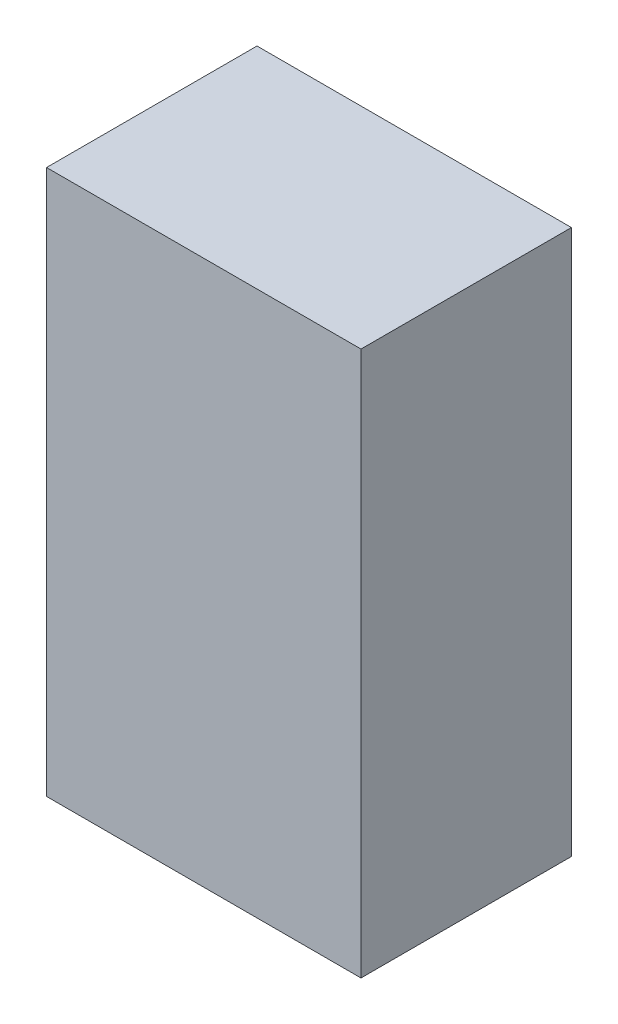
ISO-10303-21;
HEADER;
FILE_DESCRIPTION(('STEP AP214'),'2;1');
FILE_NAME('part.step','',(''),(''),'','','');
FILE_SCHEMA(('AUTOMOTIVE_DESIGN { 1 0 10303 214 1 1 1 1 }'));
ENDSEC;
DATA;
#1=APPLICATION_CONTEXT('core data for automotive mechanical design processes');
#2=APPLICATION_PROTOCOL_DEFINITION('international standard','automotive_design',2000,#1);
#3=PRODUCT_CONTEXT('',#1,'mechanical');
#4=PRODUCT('Part','Part','',(#3));
#5=PRODUCT_RELATED_PRODUCT_CATEGORY('part','',(#4));
#6=PRODUCT_DEFINITION_FORMATION('','',#4);
#7=PRODUCT_DEFINITION_CONTEXT('part definition',#1,'design');
#8=PRODUCT_DEFINITION('design','',#6,#7);
#9=PRODUCT_DEFINITION_SHAPE('','',#8);
#10=(LENGTH_UNIT() NAMED_UNIT(*) SI_UNIT(.MILLI.,.METRE.));
#11=(NAMED_UNIT(*) PLANE_ANGLE_UNIT() SI_UNIT($,.RADIAN.));
#12=(NAMED_UNIT(*) SI_UNIT($,.STERADIAN.) SOLID_ANGLE_UNIT());
#13=UNCERTAINTY_MEASURE_WITH_UNIT(LENGTH_MEASURE(1.E-05),#10,'distance_accuracy_value','');
#14=(GEOMETRIC_REPRESENTATION_CONTEXT(3) GLOBAL_UNCERTAINTY_ASSIGNED_CONTEXT((#13)) GLOBAL_UNIT_ASSIGNED_CONTEXT((#10,
#11,#12)) REPRESENTATION_CONTEXT('',''));
#15=CARTESIAN_POINT('',(0.,0.,0.));
#16=DIRECTION('',(0.,0.,1.));
#17=DIRECTION('',(1.,0.,0.));
#18=AXIS2_PLACEMENT_3D('',#15,#16,#17);
#19=CARTESIAN_POINT('',(-0.635,1.10000034,0.85000084));
#20=DIRECTION('',(0.,0.,1.));
#21=DIRECTION('',(1.,0.,0.));
#22=AXIS2_PLACEMENT_3D('',#19,#20,#21);
#23=PLANE('',#22);
#24=DIRECTION('',(0.,1.,0.));
#25=VECTOR('',#24,1.);
#26=CARTESIAN_POINT('',(0.635,1.10000034,0.85000084));
#27=LINE('',#26,#25);
#28=CARTESIAN_POINT('',(0.635,1.10000034,0.85000084));
#29=VERTEX_POINT('',#28);
#30=CARTESIAN_POINT('',(0.635,-1.10000034,0.85000084));
#31=VERTEX_POINT('',#30);
#32=EDGE_CURVE('E52',#29,#31,#27,.F.);
#33=ORIENTED_EDGE('',*,*,#32,.F.);
#34=DIRECTION('',(1.,0.,0.));
#35=VECTOR('',#34,1.);
#36=CARTESIAN_POINT('',(-0.635,1.10000034,0.85000084));
#37=LINE('',#36,#35);
#38=CARTESIAN_POINT('',(-0.635,1.10000034,0.85000084));
#39=VERTEX_POINT('',#38);
#40=EDGE_CURVE('E19',#29,#39,#37,.F.);
#41=ORIENTED_EDGE('',*,*,#40,.T.);
#42=DIRECTION('',(0.,1.,0.));
#43=VECTOR('',#42,1.);
#44=CARTESIAN_POINT('',(-0.635,-1.10000034,0.85000084));
#45=LINE('',#44,#43);
#46=CARTESIAN_POINT('',(-0.635,-1.10000034,0.85000084));
#47=VERTEX_POINT('',#46);
#48=EDGE_CURVE('E66',#47,#39,#45,.T.);
#49=ORIENTED_EDGE('',*,*,#48,.F.);
#50=DIRECTION('',(1.,0.,0.));
#51=VECTOR('',#50,1.);
#52=CARTESIAN_POINT('',(0.635,-1.10000034,0.85000084));
#53=LINE('',#52,#51);
#54=EDGE_CURVE('E57',#31,#47,#53,.F.);
#55=ORIENTED_EDGE('',*,*,#54,.F.);
#56=EDGE_LOOP('',(#33,#41,#49,#55));
#57=FACE_BOUND('',#56,.T.);
#58=ADVANCED_FACE('F16',(#57),#23,.T.);
#59=CARTESIAN_POINT('',(-0.635,-1.10000034,0.));
#60=DIRECTION('',(-1.,0.,0.));
#61=DIRECTION('',(0.,0.,1.));
#62=AXIS2_PLACEMENT_3D('',#59,#60,#61);
#63=PLANE('',#62);
#64=DIRECTION('',(0.,0.,1.));
#65=VECTOR('',#64,1.);
#66=CARTESIAN_POINT('',(-0.635,1.10000034,0.));
#67=LINE('',#66,#65);
#68=CARTESIAN_POINT('',(-0.635,1.10000034,0.));
#69=VERTEX_POINT('',#68);
#70=EDGE_CURVE('E79',#69,#39,#67,.T.);
#71=ORIENTED_EDGE('',*,*,#70,.F.);
#72=DIRECTION('',(0.,1.,0.));
#73=VECTOR('',#72,1.);
#74=CARTESIAN_POINT('',(-0.635,1.10000034,0.));
#75=LINE('',#74,#73);
#76=CARTESIAN_POINT('',(-0.635,-1.10000034,0.));
#77=VERTEX_POINT('',#76);
#78=EDGE_CURVE('E74',#69,#77,#75,.F.);
#79=ORIENTED_EDGE('',*,*,#78,.T.);
#80=DIRECTION('',(0.,0.,-1.));
#81=VECTOR('',#80,1.);
#82=CARTESIAN_POINT('',(-0.635,-1.10000034,0.));
#83=LINE('',#82,#81);
#84=EDGE_CURVE('E62',#47,#77,#83,.T.);
#85=ORIENTED_EDGE('',*,*,#84,.F.);
#86=ORIENTED_EDGE('',*,*,#48,.T.);
#87=EDGE_LOOP('',(#71,#79,#85,#86));
#88=FACE_BOUND('',#87,.T.);
#89=ADVANCED_FACE('F73',(#88),#63,.T.);
#90=CARTESIAN_POINT('',(0.635,-1.10000034,0.));
#91=DIRECTION('',(0.,-1.,0.));
#92=DIRECTION('',(0.,0.,-1.));
#93=AXIS2_PLACEMENT_3D('',#90,#91,#92);
#94=PLANE('',#93);
#95=ORIENTED_EDGE('',*,*,#84,.T.);
#96=DIRECTION('',(1.,0.,0.));
#97=VECTOR('',#96,1.);
#98=CARTESIAN_POINT('',(-0.635,-1.10000034,0.));
#99=LINE('',#98,#97);
#100=CARTESIAN_POINT('',(0.635,-1.10000034,0.));
#101=VERTEX_POINT('',#100);
#102=EDGE_CURVE('E83',#77,#101,#99,.T.);
#103=ORIENTED_EDGE('',*,*,#102,.T.);
#104=DIRECTION('',(0.,0.,-1.));
#105=VECTOR('',#104,1.);
#106=CARTESIAN_POINT('',(0.635,-1.10000034,0.));
#107=LINE('',#106,#105);
#108=EDGE_CURVE('E64',#31,#101,#107,.T.);
#109=ORIENTED_EDGE('',*,*,#108,.F.);
#110=ORIENTED_EDGE('',*,*,#54,.T.);
#111=EDGE_LOOP('',(#95,#103,#109,#110));
#112=FACE_BOUND('',#111,.T.);
#113=ADVANCED_FACE('F59',(#112),#94,.T.);
#114=CARTESIAN_POINT('',(0.635,1.10000034,0.));
#115=DIRECTION('',(1.,0.,0.));
#116=DIRECTION('',(0.,0.,-1.));
#117=AXIS2_PLACEMENT_3D('',#114,#115,#116);
#118=PLANE('',#117);
#119=ORIENTED_EDGE('',*,*,#108,.T.);
#120=DIRECTION('',(0.,1.,0.));
#121=VECTOR('',#120,1.);
#122=CARTESIAN_POINT('',(0.635,1.10000034,0.));
#123=LINE('',#122,#121);
#124=CARTESIAN_POINT('',(0.635,1.10000034,0.));
#125=VERTEX_POINT('',#124);
#126=EDGE_CURVE('E25',#101,#125,#123,.T.);
#127=ORIENTED_EDGE('',*,*,#126,.T.);
#128=DIRECTION('',(0.,0.,1.));
#129=VECTOR('',#128,1.);
#130=CARTESIAN_POINT('',(0.635,1.10000034,0.));
#131=LINE('',#130,#129);
#132=EDGE_CURVE('E33',#29,#125,#131,.F.);
#133=ORIENTED_EDGE('',*,*,#132,.F.);
#134=ORIENTED_EDGE('',*,*,#32,.T.);
#135=EDGE_LOOP('',(#119,#127,#133,#134));
#136=FACE_BOUND('',#135,.T.);
#137=ADVANCED_FACE('F87',(#136),#118,.T.);
#138=CARTESIAN_POINT('',(-0.635,1.10000034,0.));
#139=DIRECTION('',(0.,1.,0.));
#140=DIRECTION('',(0.,0.,1.));
#141=AXIS2_PLACEMENT_3D('',#138,#139,#140);
#142=PLANE('',#141);
#143=ORIENTED_EDGE('',*,*,#132,.T.);
#144=DIRECTION('',(1.,0.,0.));
#145=VECTOR('',#144,1.);
#146=CARTESIAN_POINT('',(-0.635,1.10000034,0.));
#147=LINE('',#146,#145);
#148=EDGE_CURVE('E10',#125,#69,#147,.F.);
#149=ORIENTED_EDGE('',*,*,#148,.T.);
#150=ORIENTED_EDGE('',*,*,#70,.T.);
#151=ORIENTED_EDGE('',*,*,#40,.F.);
#152=EDGE_LOOP('',(#143,#149,#150,#151));
#153=FACE_BOUND('',#152,.T.);
#154=ADVANCED_FACE('F90',(#153),#142,.T.);
#155=CARTESIAN_POINT('',(-0.635,1.10000034,0.));
#156=DIRECTION('',(0.,0.,1.));
#157=DIRECTION('',(1.,0.,0.));
#158=AXIS2_PLACEMENT_3D('',#155,#156,#157);
#159=PLANE('',#158);
#160=ORIENTED_EDGE('',*,*,#126,.F.);
#161=ORIENTED_EDGE('',*,*,#102,.F.);
#162=ORIENTED_EDGE('',*,*,#78,.F.);
#163=ORIENTED_EDGE('',*,*,#148,.F.);
#164=EDGE_LOOP('',(#160,#161,#162,#163));
#165=FACE_BOUND('',#164,.T.);
#166=ADVANCED_FACE('F89',(#165),#159,.F.);
#167=CLOSED_SHELL('',(#58,#89,#113,#137,#154,#166));
#168=MANIFOLD_SOLID_BREP('B1',#167);
#169=ADVANCED_BREP_SHAPE_REPRESENTATION('',(#18,#168),#14);
#170=SHAPE_DEFINITION_REPRESENTATION(#9,#169);
ENDSEC;
END-ISO-10303-21;
